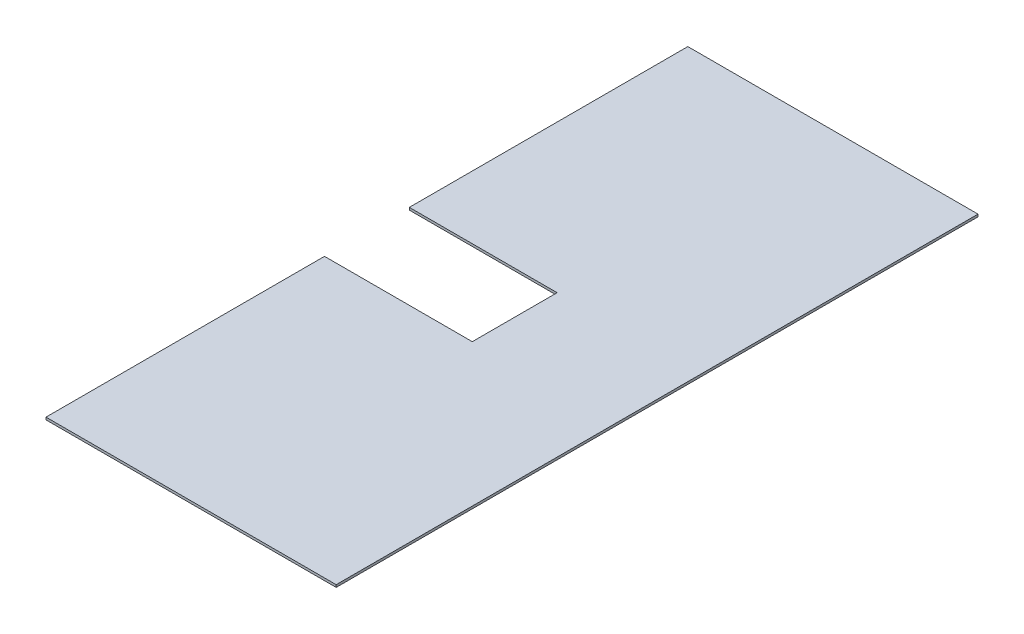
ISO-10303-21;
HEADER;
FILE_DESCRIPTION(('STEP AP214'),'2;1');
FILE_NAME('part.step','',(''),(''),'','','');
FILE_SCHEMA(('AUTOMOTIVE_DESIGN { 1 0 10303 214 1 1 1 1 }'));
ENDSEC;
DATA;
#1=APPLICATION_CONTEXT('core data for automotive mechanical design processes');
#2=APPLICATION_PROTOCOL_DEFINITION('international standard','automotive_design',2000,#1);
#3=PRODUCT_CONTEXT('',#1,'mechanical');
#4=PRODUCT('Part','Part','',(#3));
#5=PRODUCT_RELATED_PRODUCT_CATEGORY('part','',(#4));
#6=PRODUCT_DEFINITION_FORMATION('','',#4);
#7=PRODUCT_DEFINITION_CONTEXT('part definition',#1,'design');
#8=PRODUCT_DEFINITION('design','',#6,#7);
#9=PRODUCT_DEFINITION_SHAPE('','',#8);
#10=(LENGTH_UNIT() NAMED_UNIT(*) SI_UNIT(.MILLI.,.METRE.));
#11=(NAMED_UNIT(*) PLANE_ANGLE_UNIT() SI_UNIT($,.RADIAN.));
#12=(NAMED_UNIT(*) SI_UNIT($,.STERADIAN.) SOLID_ANGLE_UNIT());
#13=UNCERTAINTY_MEASURE_WITH_UNIT(LENGTH_MEASURE(1.E-05),#10,'distance_accuracy_value','');
#14=(GEOMETRIC_REPRESENTATION_CONTEXT(3) GLOBAL_UNCERTAINTY_ASSIGNED_CONTEXT((#13)) GLOBAL_UNIT_ASSIGNED_CONTEXT((#10,
#11,#12)) REPRESENTATION_CONTEXT('',''));
#15=CARTESIAN_POINT('',(0.,0.,0.));
#16=DIRECTION('',(0.,0.,1.));
#17=DIRECTION('',(1.,0.,0.));
#18=AXIS2_PLACEMENT_3D('',#15,#16,#17);
#19=CARTESIAN_POINT('',(-362.597814819386,3.,-401.000000000001));
#20=DIRECTION('',(1.,0.,0.));
#21=DIRECTION('',(0.,0.,-1.));
#22=AXIS2_PLACEMENT_3D('',#19,#20,#21);
#23=PLANE('',#22);
#24=DIRECTION('',(0.,0.,1.));
#25=VECTOR('',#24,1.);
#26=CARTESIAN_POINT('',(-362.597814819386,0.,-401.000000000001));
#27=LINE('',#26,#25);
#28=CARTESIAN_POINT('',(-362.597814819386,0.,-401.000000000001));
#29=VERTEX_POINT('',#28);
#30=CARTESIAN_POINT('',(-362.597814819386,0.,-53.0000000000011));
#31=VERTEX_POINT('',#30);
#32=EDGE_CURVE('E135',#29,#31,#27,.T.);
#33=ORIENTED_EDGE('',*,*,#32,.T.);
#34=DIRECTION('',(0.,-1.,0.));
#35=VECTOR('',#34,1.);
#36=CARTESIAN_POINT('',(-362.597814819386,3.,-53.0000000000011));
#37=LINE('',#36,#35);
#38=CARTESIAN_POINT('',(-362.597814819386,3.,-53.0000000000011));
#39=VERTEX_POINT('',#38);
#40=EDGE_CURVE('E11',#39,#31,#37,.T.);
#41=ORIENTED_EDGE('',*,*,#40,.F.);
#42=DIRECTION('',(0.,0.,1.));
#43=VECTOR('',#42,1.);
#44=CARTESIAN_POINT('',(-362.597814819386,3.,-401.000000000001));
#45=LINE('',#44,#43);
#46=CARTESIAN_POINT('',(-362.597814819386,3.,-401.000000000001));
#47=VERTEX_POINT('',#46);
#48=EDGE_CURVE('E149',#47,#39,#45,.T.);
#49=ORIENTED_EDGE('',*,*,#48,.F.);
#50=DIRECTION('',(0.,-1.,0.));
#51=VECTOR('',#50,1.);
#52=CARTESIAN_POINT('',(-362.597814819386,3.,-401.000000000001));
#53=LINE('',#52,#51);
#54=EDGE_CURVE('E131',#47,#29,#53,.T.);
#55=ORIENTED_EDGE('',*,*,#54,.T.);
#56=EDGE_LOOP('',(#33,#41,#49,#55));
#57=FACE_BOUND('',#56,.T.);
#58=ADVANCED_FACE('F39',(#57),#23,.F.);
#59=CARTESIAN_POINT('',(-362.597814819386,3.,-53.0000000000011));
#60=DIRECTION('',(0.,0.,-1.));
#61=DIRECTION('',(-1.,0.,0.));
#62=AXIS2_PLACEMENT_3D('',#59,#60,#61);
#63=PLANE('',#62);
#64=DIRECTION('',(1.,0.,0.));
#65=VECTOR('',#64,1.);
#66=CARTESIAN_POINT('',(-362.597814819386,0.,-53.0000000000011));
#67=LINE('',#66,#65);
#68=CARTESIAN_POINT('',(-177.911796051964,0.,-53.0000000000012));
#69=VERTEX_POINT('',#68);
#70=EDGE_CURVE('E138',#31,#69,#67,.T.);
#71=ORIENTED_EDGE('',*,*,#70,.T.);
#72=DIRECTION('',(0.,-1.,0.));
#73=VECTOR('',#72,1.);
#74=CARTESIAN_POINT('',(-177.911796051964,3.,-53.0000000000012));
#75=LINE('',#74,#73);
#76=CARTESIAN_POINT('',(-177.911796051964,3.,-53.0000000000012));
#77=VERTEX_POINT('',#76);
#78=EDGE_CURVE('E47',#77,#69,#75,.T.);
#79=ORIENTED_EDGE('',*,*,#78,.F.);
#80=DIRECTION('',(1.,0.,0.));
#81=VECTOR('',#80,1.);
#82=CARTESIAN_POINT('',(-362.597814819386,3.,-53.0000000000011));
#83=LINE('',#82,#81);
#84=EDGE_CURVE('E98',#39,#77,#83,.T.);
#85=ORIENTED_EDGE('',*,*,#84,.F.);
#86=ORIENTED_EDGE('',*,*,#40,.T.);
#87=EDGE_LOOP('',(#71,#79,#85,#86));
#88=FACE_BOUND('',#87,.T.);
#89=ADVANCED_FACE('F184',(#88),#63,.F.);
#90=CARTESIAN_POINT('',(-177.911796051964,3.,-53.0000000000012));
#91=DIRECTION('',(1.,0.,0.));
#92=DIRECTION('',(0.,0.,-1.));
#93=AXIS2_PLACEMENT_3D('',#90,#91,#92);
#94=PLANE('',#93);
#95=DIRECTION('',(0.,0.,1.));
#96=VECTOR('',#95,1.);
#97=CARTESIAN_POINT('',(-177.911796051964,0.,-53.0000000000012));
#98=LINE('',#97,#96);
#99=CARTESIAN_POINT('',(-177.911796051964,0.,53.0000000000013));
#100=VERTEX_POINT('',#99);
#101=EDGE_CURVE('E140',#69,#100,#98,.T.);
#102=ORIENTED_EDGE('',*,*,#101,.T.);
#103=DIRECTION('',(0.,-1.,0.));
#104=VECTOR('',#103,1.);
#105=CARTESIAN_POINT('',(-177.911796051964,3.,53.0000000000013));
#106=LINE('',#105,#104);
#107=CARTESIAN_POINT('',(-177.911796051964,3.,53.0000000000013));
#108=VERTEX_POINT('',#107);
#109=EDGE_CURVE('E156',#108,#100,#106,.T.);
#110=ORIENTED_EDGE('',*,*,#109,.F.);
#111=DIRECTION('',(0.,0.,1.));
#112=VECTOR('',#111,1.);
#113=CARTESIAN_POINT('',(-177.911796051964,3.,-53.0000000000012));
#114=LINE('',#113,#112);
#115=EDGE_CURVE('E164',#77,#108,#114,.T.);
#116=ORIENTED_EDGE('',*,*,#115,.F.);
#117=ORIENTED_EDGE('',*,*,#78,.T.);
#118=EDGE_LOOP('',(#102,#110,#116,#117));
#119=FACE_BOUND('',#118,.T.);
#120=ADVANCED_FACE('F162',(#119),#94,.F.);
#121=CARTESIAN_POINT('',(-362.597814819386,3.,53.0000000000014));
#122=DIRECTION('',(0.,0.,1.));
#123=DIRECTION('',(1.,0.,0.));
#124=AXIS2_PLACEMENT_3D('',#121,#122,#123);
#125=PLANE('',#124);
#126=DIRECTION('',(-1.,0.,0.));
#127=VECTOR('',#126,1.);
#128=CARTESIAN_POINT('',(-362.597814819386,0.,53.0000000000014));
#129=LINE('',#128,#127);
#130=CARTESIAN_POINT('',(-362.597814819386,0.,53.0000000000014));
#131=VERTEX_POINT('',#130);
#132=EDGE_CURVE('E142',#100,#131,#129,.T.);
#133=ORIENTED_EDGE('',*,*,#132,.T.);
#134=DIRECTION('',(0.,-1.,0.));
#135=VECTOR('',#134,1.);
#136=CARTESIAN_POINT('',(-362.597814819386,3.,53.0000000000014));
#137=LINE('',#136,#135);
#138=CARTESIAN_POINT('',(-362.597814819386,3.,53.0000000000014));
#139=VERTEX_POINT('',#138);
#140=EDGE_CURVE('E153',#139,#131,#137,.T.);
#141=ORIENTED_EDGE('',*,*,#140,.F.);
#142=DIRECTION('',(-1.,0.,0.));
#143=VECTOR('',#142,1.);
#144=CARTESIAN_POINT('',(-362.597814819386,3.,53.0000000000014));
#145=LINE('',#144,#143);
#146=EDGE_CURVE('E176',#108,#139,#145,.T.);
#147=ORIENTED_EDGE('',*,*,#146,.F.);
#148=ORIENTED_EDGE('',*,*,#109,.T.);
#149=EDGE_LOOP('',(#133,#141,#147,#148));
#150=FACE_BOUND('',#149,.T.);
#151=ADVANCED_FACE('F172',(#150),#125,.F.);
#152=CARTESIAN_POINT('',(-362.597814819386,3.,53.0000000000014));
#153=DIRECTION('',(1.,0.,0.));
#154=DIRECTION('',(0.,0.,-1.));
#155=AXIS2_PLACEMENT_3D('',#152,#153,#154);
#156=PLANE('',#155);
#157=DIRECTION('',(0.,0.,1.));
#158=VECTOR('',#157,1.);
#159=CARTESIAN_POINT('',(-362.597814819386,0.,53.0000000000014));
#160=LINE('',#159,#158);
#161=CARTESIAN_POINT('',(-362.597814819385,0.,401.000000000001));
#162=VERTEX_POINT('',#161);
#163=EDGE_CURVE('E144',#131,#162,#160,.T.);
#164=ORIENTED_EDGE('',*,*,#163,.T.);
#165=DIRECTION('',(0.,-1.,0.));
#166=VECTOR('',#165,1.);
#167=CARTESIAN_POINT('',(-362.597814819385,3.,401.000000000001));
#168=LINE('',#167,#166);
#169=CARTESIAN_POINT('',(-362.597814819385,3.,401.000000000001));
#170=VERTEX_POINT('',#169);
#171=EDGE_CURVE('E126',#170,#162,#168,.T.);
#172=ORIENTED_EDGE('',*,*,#171,.F.);
#173=DIRECTION('',(0.,0.,1.));
#174=VECTOR('',#173,1.);
#175=CARTESIAN_POINT('',(-362.597814819386,3.,53.0000000000014));
#176=LINE('',#175,#174);
#177=EDGE_CURVE('E117',#139,#170,#176,.T.);
#178=ORIENTED_EDGE('',*,*,#177,.F.);
#179=ORIENTED_EDGE('',*,*,#140,.T.);
#180=EDGE_LOOP('',(#164,#172,#178,#179));
#181=FACE_BOUND('',#180,.T.);
#182=ADVANCED_FACE('F175',(#181),#156,.F.);
#183=CARTESIAN_POINT('',(-362.597814819385,3.,401.000000000001));
#184=DIRECTION('',(0.,0.,-1.));
#185=DIRECTION('',(-1.,0.,0.));
#186=AXIS2_PLACEMENT_3D('',#183,#184,#185);
#187=PLANE('',#186);
#188=DIRECTION('',(1.,0.,0.));
#189=VECTOR('',#188,1.);
#190=CARTESIAN_POINT('',(-362.597814819385,0.,401.000000000001));
#191=LINE('',#190,#189);
#192=CARTESIAN_POINT('',(4.44089209850063E-13,0.,401.000000000001));
#193=VERTEX_POINT('',#192);
#194=EDGE_CURVE('E125',#162,#193,#191,.T.);
#195=ORIENTED_EDGE('',*,*,#194,.T.);
#196=DIRECTION('',(0.,-1.,0.));
#197=VECTOR('',#196,1.);
#198=CARTESIAN_POINT('',(4.44089209850063E-13,3.,401.000000000001));
#199=LINE('',#198,#197);
#200=CARTESIAN_POINT('',(4.44089209850063E-13,3.,401.000000000001));
#201=VERTEX_POINT('',#200);
#202=EDGE_CURVE('E122',#201,#193,#199,.T.);
#203=ORIENTED_EDGE('',*,*,#202,.F.);
#204=DIRECTION('',(1.,0.,0.));
#205=VECTOR('',#204,1.);
#206=CARTESIAN_POINT('',(-362.597814819385,3.,401.000000000001));
#207=LINE('',#206,#205);
#208=EDGE_CURVE('E111',#170,#201,#207,.T.);
#209=ORIENTED_EDGE('',*,*,#208,.F.);
#210=ORIENTED_EDGE('',*,*,#171,.T.);
#211=EDGE_LOOP('',(#195,#203,#209,#210));
#212=FACE_BOUND('',#211,.T.);
#213=ADVANCED_FACE('F123',(#212),#187,.F.);
#214=CARTESIAN_POINT('',(0.,3.,-401.000000000001));
#215=DIRECTION('',(-1.,0.,0.));
#216=DIRECTION('',(0.,0.,1.));
#217=AXIS2_PLACEMENT_3D('',#214,#215,#216);
#218=PLANE('',#217);
#219=DIRECTION('',(0.,0.,-1.));
#220=VECTOR('',#219,1.);
#221=CARTESIAN_POINT('',(0.,0.,-401.000000000001));
#222=LINE('',#221,#220);
#223=CARTESIAN_POINT('',(0.,0.,-401.000000000001));
#224=VERTEX_POINT('',#223);
#225=EDGE_CURVE('E84',#193,#224,#222,.T.);
#226=ORIENTED_EDGE('',*,*,#225,.T.);
#227=DIRECTION('',(0.,-1.,0.));
#228=VECTOR('',#227,1.);
#229=CARTESIAN_POINT('',(0.,3.,-401.000000000001));
#230=LINE('',#229,#228);
#231=CARTESIAN_POINT('',(0.,3.,-401.000000000001));
#232=VERTEX_POINT('',#231);
#233=EDGE_CURVE('E127',#232,#224,#230,.T.);
#234=ORIENTED_EDGE('',*,*,#233,.F.);
#235=DIRECTION('',(0.,0.,-1.));
#236=VECTOR('',#235,1.);
#237=CARTESIAN_POINT('',(0.,3.,-401.000000000001));
#238=LINE('',#237,#236);
#239=EDGE_CURVE('E115',#201,#232,#238,.T.);
#240=ORIENTED_EDGE('',*,*,#239,.F.);
#241=ORIENTED_EDGE('',*,*,#202,.T.);
#242=EDGE_LOOP('',(#226,#234,#240,#241));
#243=FACE_BOUND('',#242,.T.);
#244=ADVANCED_FACE('F129',(#243),#218,.F.);
#245=CARTESIAN_POINT('',(-362.597814819386,3.,-401.000000000001));
#246=DIRECTION('',(0.,0.,1.));
#247=DIRECTION('',(1.,0.,0.));
#248=AXIS2_PLACEMENT_3D('',#245,#246,#247);
#249=PLANE('',#248);
#250=DIRECTION('',(-1.,0.,0.));
#251=VECTOR('',#250,1.);
#252=CARTESIAN_POINT('',(-362.597814819386,0.,-401.000000000001));
#253=LINE('',#252,#251);
#254=EDGE_CURVE('E90',#224,#29,#253,.T.);
#255=ORIENTED_EDGE('',*,*,#254,.T.);
#256=ORIENTED_EDGE('',*,*,#54,.F.);
#257=DIRECTION('',(-1.,0.,0.));
#258=VECTOR('',#257,1.);
#259=CARTESIAN_POINT('',(-362.597814819386,3.,-401.000000000001));
#260=LINE('',#259,#258);
#261=EDGE_CURVE('E55',#232,#47,#260,.T.);
#262=ORIENTED_EDGE('',*,*,#261,.F.);
#263=ORIENTED_EDGE('',*,*,#233,.T.);
#264=EDGE_LOOP('',(#255,#256,#262,#263));
#265=FACE_BOUND('',#264,.T.);
#266=ADVANCED_FACE('F200',(#265),#249,.F.);
#267=CARTESIAN_POINT('',(0.,3.,0.));
#268=DIRECTION('',(0.,1.,0.));
#269=DIRECTION('',(0.,0.,1.));
#270=AXIS2_PLACEMENT_3D('',#267,#268,#269);
#271=PLANE('',#270);
#272=ORIENTED_EDGE('',*,*,#48,.T.);
#273=ORIENTED_EDGE('',*,*,#84,.T.);
#274=ORIENTED_EDGE('',*,*,#115,.T.);
#275=ORIENTED_EDGE('',*,*,#146,.T.);
#276=ORIENTED_EDGE('',*,*,#177,.T.);
#277=ORIENTED_EDGE('',*,*,#208,.T.);
#278=ORIENTED_EDGE('',*,*,#239,.T.);
#279=ORIENTED_EDGE('',*,*,#261,.T.);
#280=EDGE_LOOP('',(#272,#273,#274,#275,#276,#277,#278,#279));
#281=FACE_BOUND('',#280,.T.);
#282=ADVANCED_FACE('F113',(#281),#271,.T.);
#283=CARTESIAN_POINT('',(0.,0.,0.));
#284=DIRECTION('',(0.,1.,0.));
#285=DIRECTION('',(0.,0.,1.));
#286=AXIS2_PLACEMENT_3D('',#283,#284,#285);
#287=PLANE('',#286);
#288=ORIENTED_EDGE('',*,*,#32,.F.);
#289=ORIENTED_EDGE('',*,*,#254,.F.);
#290=ORIENTED_EDGE('',*,*,#225,.F.);
#291=ORIENTED_EDGE('',*,*,#194,.F.);
#292=ORIENTED_EDGE('',*,*,#163,.F.);
#293=ORIENTED_EDGE('',*,*,#132,.F.);
#294=ORIENTED_EDGE('',*,*,#101,.F.);
#295=ORIENTED_EDGE('',*,*,#70,.F.);
#296=EDGE_LOOP('',(#288,#289,#290,#291,#292,#293,#294,#295));
#297=FACE_BOUND('',#296,.T.);
#298=ADVANCED_FACE('F168',(#297),#287,.F.);
#299=CLOSED_SHELL('',(#58,#89,#120,#151,#182,#213,#244,#266,#282,#298));
#300=MANIFOLD_SOLID_BREP('B2',#299);
#301=ADVANCED_BREP_SHAPE_REPRESENTATION('',(#18,#300),#14);
#302=SHAPE_DEFINITION_REPRESENTATION(#9,#301);
ENDSEC;
END-ISO-10303-21;
